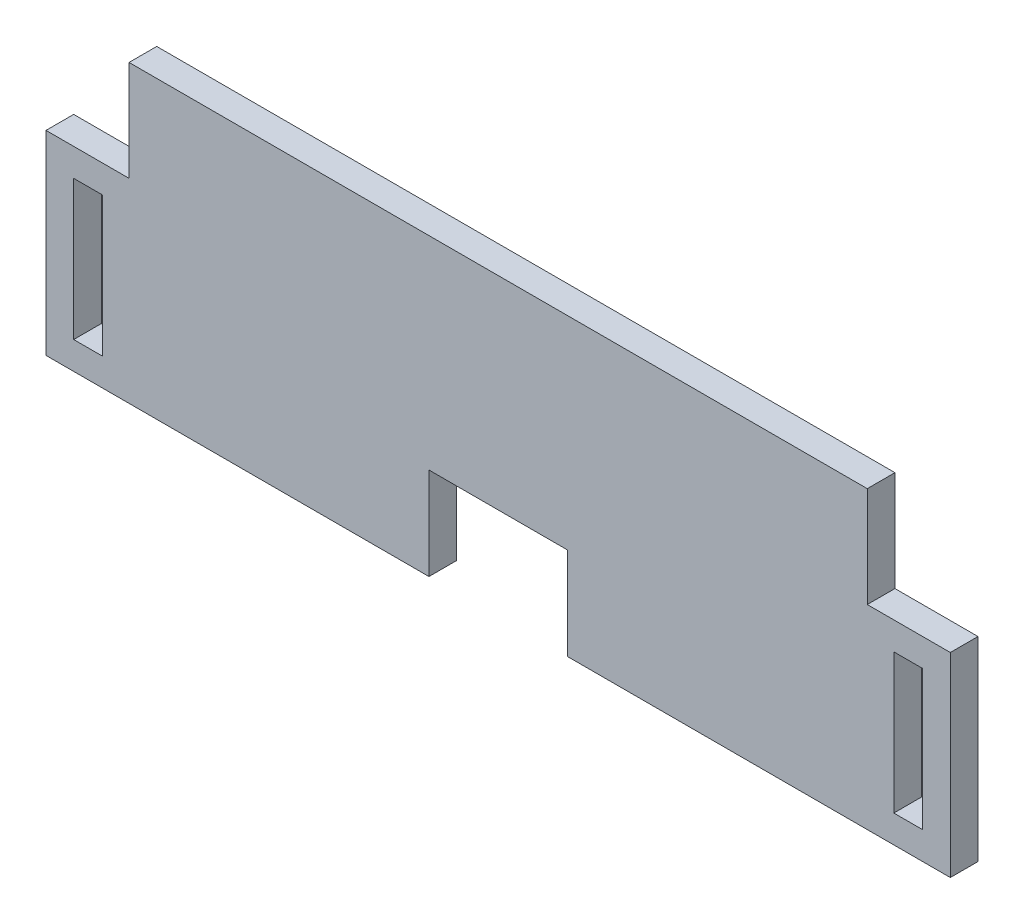
ISO-10303-21;
HEADER;
FILE_DESCRIPTION(('STEP AP214'),'2;1');
FILE_NAME('part.step','',(''),(''),'','','');
FILE_SCHEMA(('AUTOMOTIVE_DESIGN { 1 0 10303 214 1 1 1 1 }'));
ENDSEC;
DATA;
#1=APPLICATION_CONTEXT('core data for automotive mechanical design processes');
#2=APPLICATION_PROTOCOL_DEFINITION('international standard','automotive_design',2000,#1);
#3=PRODUCT_CONTEXT('',#1,'mechanical');
#4=PRODUCT('Part','Part','',(#3));
#5=PRODUCT_RELATED_PRODUCT_CATEGORY('part','',(#4));
#6=PRODUCT_DEFINITION_FORMATION('','',#4);
#7=PRODUCT_DEFINITION_CONTEXT('part definition',#1,'design');
#8=PRODUCT_DEFINITION('design','',#6,#7);
#9=PRODUCT_DEFINITION_SHAPE('','',#8);
#10=(LENGTH_UNIT() NAMED_UNIT(*) SI_UNIT(.MILLI.,.METRE.));
#11=(NAMED_UNIT(*) PLANE_ANGLE_UNIT() SI_UNIT($,.RADIAN.));
#12=(NAMED_UNIT(*) SI_UNIT($,.STERADIAN.) SOLID_ANGLE_UNIT());
#13=UNCERTAINTY_MEASURE_WITH_UNIT(LENGTH_MEASURE(1.E-05),#10,'distance_accuracy_value','');
#14=(GEOMETRIC_REPRESENTATION_CONTEXT(3) GLOBAL_UNCERTAINTY_ASSIGNED_CONTEXT((#13)) GLOBAL_UNIT_ASSIGNED_CONTEXT((#10,
#11,#12)) REPRESENTATION_CONTEXT('',''));
#15=CARTESIAN_POINT('',(0.,0.,0.));
#16=DIRECTION('',(0.,0.,1.));
#17=DIRECTION('',(1.,0.,0.));
#18=AXIS2_PLACEMENT_3D('',#15,#16,#17);
#19=CARTESIAN_POINT('',(0.,0.,3.));
#20=DIRECTION('',(0.,1.,0.));
#21=DIRECTION('',(0.,0.,1.));
#22=AXIS2_PLACEMENT_3D('',#19,#20,#21);
#23=PLANE('',#22);
#24=DIRECTION('',(0.,0.,1.));
#25=VECTOR('',#24,1.);
#26=CARTESIAN_POINT('',(7.5,0.,0.));
#27=LINE('',#26,#25);
#28=CARTESIAN_POINT('',(7.5,0.,0.));
#29=VERTEX_POINT('',#28);
#30=CARTESIAN_POINT('',(7.5,0.,3.));
#31=VERTEX_POINT('',#30);
#32=EDGE_CURVE('E243',#29,#31,#27,.T.);
#33=ORIENTED_EDGE('',*,*,#32,.F.);
#34=DIRECTION('',(1.,0.,0.));
#35=VECTOR('',#34,1.);
#36=CARTESIAN_POINT('',(0.,0.,0.));
#37=LINE('',#36,#35);
#38=CARTESIAN_POINT('',(49.,0.,0.));
#39=VERTEX_POINT('',#38);
#40=EDGE_CURVE('E238',#29,#39,#37,.T.);
#41=ORIENTED_EDGE('',*,*,#40,.T.);
#42=DIRECTION('',(0.,0.,-1.));
#43=VECTOR('',#42,1.);
#44=CARTESIAN_POINT('',(49.,0.,3.));
#45=LINE('',#44,#43);
#46=CARTESIAN_POINT('',(49.,0.,3.));
#47=VERTEX_POINT('',#46);
#48=EDGE_CURVE('E219',#47,#39,#45,.T.);
#49=ORIENTED_EDGE('',*,*,#48,.F.);
#50=DIRECTION('',(1.,0.,0.));
#51=VECTOR('',#50,1.);
#52=CARTESIAN_POINT('',(0.,0.,3.));
#53=LINE('',#52,#51);
#54=EDGE_CURVE('E283',#31,#47,#53,.T.);
#55=ORIENTED_EDGE('',*,*,#54,.F.);
#56=EDGE_LOOP('',(#33,#41,#49,#55));
#57=FACE_BOUND('',#56,.T.);
#58=ADVANCED_FACE('F39',(#57),#23,.F.);
#59=DIRECTION('',(0.,0.,1.));
#60=VECTOR('',#59,1.);
#61=CARTESIAN_POINT('',(-7.5,0.,0.));
#62=LINE('',#61,#60);
#63=CARTESIAN_POINT('',(-7.5,0.,0.));
#64=VERTEX_POINT('',#63);
#65=CARTESIAN_POINT('',(-7.5,0.,3.));
#66=VERTEX_POINT('',#65);
#67=EDGE_CURVE('E56',#64,#66,#62,.T.);
#68=ORIENTED_EDGE('',*,*,#67,.T.);
#69=CARTESIAN_POINT('',(-49.,0.,3.));
#70=VERTEX_POINT('',#69);
#71=EDGE_CURVE('E127',#70,#66,#53,.T.);
#72=ORIENTED_EDGE('',*,*,#71,.F.);
#73=DIRECTION('',(0.,0.,-1.));
#74=VECTOR('',#73,1.);
#75=CARTESIAN_POINT('',(-49.,0.,3.));
#76=LINE('',#75,#74);
#77=CARTESIAN_POINT('',(-49.,0.,0.));
#78=VERTEX_POINT('',#77);
#79=EDGE_CURVE('E43',#70,#78,#76,.T.);
#80=ORIENTED_EDGE('',*,*,#79,.T.);
#81=EDGE_CURVE('E230',#78,#64,#37,.T.);
#82=ORIENTED_EDGE('',*,*,#81,.T.);
#83=EDGE_LOOP('',(#68,#72,#80,#82));
#84=FACE_BOUND('',#83,.T.);
#85=ADVANCED_FACE('F229',(#84),#23,.F.);
#86=CARTESIAN_POINT('',(0.,0.,3.));
#87=DIRECTION('',(0.,0.,1.));
#88=DIRECTION('',(1.,0.,0.));
#89=AXIS2_PLACEMENT_3D('',#86,#87,#88);
#90=PLANE('',#89);
#91=DIRECTION('',(1.,0.,0.));
#92=VECTOR('',#91,1.);
#93=CARTESIAN_POINT('',(0.,18.123,3.));
#94=LINE('',#93,#92);
#95=CARTESIAN_POINT('',(-46.,18.123,3.));
#96=VERTEX_POINT('',#95);
#97=CARTESIAN_POINT('',(-42.877,18.123,3.));
#98=VERTEX_POINT('',#97);
#99=EDGE_CURVE('E302',#96,#98,#94,.T.);
#100=ORIENTED_EDGE('',*,*,#99,.T.);
#101=DIRECTION('',(0.,-1.,0.));
#102=VECTOR('',#101,1.);
#103=CARTESIAN_POINT('',(-42.877,0.,3.));
#104=LINE('',#103,#102);
#105=CARTESIAN_POINT('',(-42.877,2.99299999999999,3.));
#106=VERTEX_POINT('',#105);
#107=EDGE_CURVE('E305',#98,#106,#104,.T.);
#108=ORIENTED_EDGE('',*,*,#107,.T.);
#109=DIRECTION('',(1.,0.,0.));
#110=VECTOR('',#109,1.);
#111=CARTESIAN_POINT('',(0.,2.99299999999999,3.));
#112=LINE('',#111,#110);
#113=CARTESIAN_POINT('',(-46.,2.99299999999999,3.));
#114=VERTEX_POINT('',#113);
#115=EDGE_CURVE('E307',#114,#106,#112,.T.);
#116=ORIENTED_EDGE('',*,*,#115,.F.);
#117=DIRECTION('',(0.,-1.,0.));
#118=VECTOR('',#117,1.);
#119=CARTESIAN_POINT('',(-46.,0.,3.));
#120=LINE('',#119,#118);
#121=EDGE_CURVE('E310',#96,#114,#120,.T.);
#122=ORIENTED_EDGE('',*,*,#121,.F.);
#123=EDGE_LOOP('',(#100,#108,#116,#122));
#124=FACE_BOUND('',#123,.T.);
#125=DIRECTION('',(-1.,0.,0.));
#126=VECTOR('',#125,1.);
#127=CARTESIAN_POINT('',(0.,18.123,3.));
#128=LINE('',#127,#126);
#129=CARTESIAN_POINT('',(46.,18.123,3.));
#130=VERTEX_POINT('',#129);
#131=CARTESIAN_POINT('',(42.877,18.123,3.));
#132=VERTEX_POINT('',#131);
#133=EDGE_CURVE('E187',#130,#132,#128,.T.);
#134=ORIENTED_EDGE('',*,*,#133,.F.);
#135=DIRECTION('',(0.,-1.,0.));
#136=VECTOR('',#135,1.);
#137=CARTESIAN_POINT('',(46.,0.,3.));
#138=LINE('',#137,#136);
#139=CARTESIAN_POINT('',(46.,2.993,3.));
#140=VERTEX_POINT('',#139);
#141=EDGE_CURVE('E181',#130,#140,#138,.T.);
#142=ORIENTED_EDGE('',*,*,#141,.T.);
#143=DIRECTION('',(-1.,0.,0.));
#144=VECTOR('',#143,1.);
#145=CARTESIAN_POINT('',(0.,2.99299999999999,3.));
#146=LINE('',#145,#144);
#147=CARTESIAN_POINT('',(42.877,2.993,3.));
#148=VERTEX_POINT('',#147);
#149=EDGE_CURVE('E171',#140,#148,#146,.T.);
#150=ORIENTED_EDGE('',*,*,#149,.T.);
#151=DIRECTION('',(0.,-1.,0.));
#152=VECTOR('',#151,1.);
#153=CARTESIAN_POINT('',(42.877,0.,3.));
#154=LINE('',#153,#152);
#155=EDGE_CURVE('E180',#132,#148,#154,.T.);
#156=ORIENTED_EDGE('',*,*,#155,.F.);
#157=EDGE_LOOP('',(#134,#142,#150,#156));
#158=FACE_BOUND('',#157,.T.);
#159=DIRECTION('',(1.,0.,0.));
#160=VECTOR('',#159,1.);
#161=CARTESIAN_POINT('',(-7.5,10.,3.));
#162=LINE('',#161,#160);
#163=CARTESIAN_POINT('',(-7.5,10.,3.));
#164=VERTEX_POINT('',#163);
#165=CARTESIAN_POINT('',(7.5,10.,3.));
#166=VERTEX_POINT('',#165);
#167=EDGE_CURVE('E342',#164,#166,#162,.T.);
#168=ORIENTED_EDGE('',*,*,#167,.T.);
#169=DIRECTION('',(0.,-1.,0.));
#170=VECTOR('',#169,1.);
#171=CARTESIAN_POINT('',(7.5,10.,3.));
#172=LINE('',#171,#170);
#173=EDGE_CURVE('E345',#166,#31,#172,.T.);
#174=ORIENTED_EDGE('',*,*,#173,.T.);
#175=ORIENTED_EDGE('',*,*,#54,.T.);
#176=DIRECTION('',(0.,-1.,0.));
#177=VECTOR('',#176,1.);
#178=CARTESIAN_POINT('',(49.,0.,3.));
#179=LINE('',#178,#177);
#180=CARTESIAN_POINT('',(49.,21.123,3.));
#181=VERTEX_POINT('',#180);
#182=EDGE_CURVE('E288',#181,#47,#179,.T.);
#183=ORIENTED_EDGE('',*,*,#182,.F.);
#184=DIRECTION('',(1.,0.,0.));
#185=VECTOR('',#184,1.);
#186=CARTESIAN_POINT('',(0.,21.123,3.));
#187=LINE('',#186,#185);
#188=CARTESIAN_POINT('',(40.,21.123,3.));
#189=VERTEX_POINT('',#188);
#190=EDGE_CURVE('E290',#189,#181,#187,.T.);
#191=ORIENTED_EDGE('',*,*,#190,.F.);
#192=DIRECTION('',(0.,1.,0.));
#193=VECTOR('',#192,1.);
#194=CARTESIAN_POINT('',(40.,0.,3.));
#195=LINE('',#194,#193);
#196=CARTESIAN_POINT('',(40.,32.,3.));
#197=VERTEX_POINT('',#196);
#198=EDGE_CURVE('E293',#189,#197,#195,.T.);
#199=ORIENTED_EDGE('',*,*,#198,.T.);
#200=DIRECTION('',(-1.,0.,0.));
#201=VECTOR('',#200,1.);
#202=CARTESIAN_POINT('',(0.,32.,3.));
#203=LINE('',#202,#201);
#204=CARTESIAN_POINT('',(-40.,32.,3.));
#205=VERTEX_POINT('',#204);
#206=EDGE_CURVE('E295',#197,#205,#203,.T.);
#207=ORIENTED_EDGE('',*,*,#206,.T.);
#208=DIRECTION('',(0.,1.,0.));
#209=VECTOR('',#208,1.);
#210=CARTESIAN_POINT('',(-40.,0.,3.));
#211=LINE('',#210,#209);
#212=CARTESIAN_POINT('',(-40.,21.123,3.));
#213=VERTEX_POINT('',#212);
#214=EDGE_CURVE('E297',#213,#205,#211,.T.);
#215=ORIENTED_EDGE('',*,*,#214,.F.);
#216=DIRECTION('',(-1.,0.,0.));
#217=VECTOR('',#216,1.);
#218=CARTESIAN_POINT('',(0.,21.123,3.));
#219=LINE('',#218,#217);
#220=CARTESIAN_POINT('',(-49.,21.123,3.));
#221=VERTEX_POINT('',#220);
#222=EDGE_CURVE('E300',#213,#221,#219,.T.);
#223=ORIENTED_EDGE('',*,*,#222,.T.);
#224=DIRECTION('',(0.,-1.,0.));
#225=VECTOR('',#224,1.);
#226=CARTESIAN_POINT('',(-49.,0.,3.));
#227=LINE('',#226,#225);
#228=EDGE_CURVE('E281',#221,#70,#227,.T.);
#229=ORIENTED_EDGE('',*,*,#228,.T.);
#230=ORIENTED_EDGE('',*,*,#71,.T.);
#231=DIRECTION('',(0.,1.,0.));
#232=VECTOR('',#231,1.);
#233=CARTESIAN_POINT('',(-7.5,0.,3.));
#234=LINE('',#233,#232);
#235=EDGE_CURVE('E339',#66,#164,#234,.T.);
#236=ORIENTED_EDGE('',*,*,#235,.T.);
#237=EDGE_LOOP('',(#168,#174,#175,#183,#191,#199,#207,#215,#223,#229,#230,#236));
#238=FACE_BOUND('',#237,.T.);
#239=ADVANCED_FACE('F185',(#124,#158,#238),#90,.T.);
#240=CARTESIAN_POINT('',(0.,0.,0.));
#241=DIRECTION('',(0.,0.,1.));
#242=DIRECTION('',(1.,0.,0.));
#243=AXIS2_PLACEMENT_3D('',#240,#241,#242);
#244=PLANE('',#243);
#245=DIRECTION('',(-1.,0.,0.));
#246=VECTOR('',#245,1.);
#247=CARTESIAN_POINT('',(0.,18.123,0.));
#248=LINE('',#247,#246);
#249=CARTESIAN_POINT('',(46.,18.123,0.));
#250=VERTEX_POINT('',#249);
#251=CARTESIAN_POINT('',(42.877,18.123,0.));
#252=VERTEX_POINT('',#251);
#253=EDGE_CURVE('E274',#250,#252,#248,.T.);
#254=ORIENTED_EDGE('',*,*,#253,.T.);
#255=DIRECTION('',(0.,-1.,0.));
#256=VECTOR('',#255,1.);
#257=CARTESIAN_POINT('',(42.877,0.,0.));
#258=LINE('',#257,#256);
#259=CARTESIAN_POINT('',(42.877,2.993,0.));
#260=VERTEX_POINT('',#259);
#261=EDGE_CURVE('E279',#252,#260,#258,.T.);
#262=ORIENTED_EDGE('',*,*,#261,.T.);
#263=DIRECTION('',(-1.,0.,0.));
#264=VECTOR('',#263,1.);
#265=CARTESIAN_POINT('',(0.,2.99299999999999,0.));
#266=LINE('',#265,#264);
#267=CARTESIAN_POINT('',(46.,2.993,0.));
#268=VERTEX_POINT('',#267);
#269=EDGE_CURVE('E277',#268,#260,#266,.T.);
#270=ORIENTED_EDGE('',*,*,#269,.F.);
#271=DIRECTION('',(0.,-1.,0.));
#272=VECTOR('',#271,1.);
#273=CARTESIAN_POINT('',(46.,0.,0.));
#274=LINE('',#273,#272);
#275=EDGE_CURVE('E192',#250,#268,#274,.T.);
#276=ORIENTED_EDGE('',*,*,#275,.F.);
#277=EDGE_LOOP('',(#254,#262,#270,#276));
#278=FACE_BOUND('',#277,.T.);
#279=DIRECTION('',(1.,0.,0.));
#280=VECTOR('',#279,1.);
#281=CARTESIAN_POINT('',(0.,18.123,0.));
#282=LINE('',#281,#280);
#283=CARTESIAN_POINT('',(-46.,18.123,0.));
#284=VERTEX_POINT('',#283);
#285=CARTESIAN_POINT('',(-42.877,18.123,0.));
#286=VERTEX_POINT('',#285);
#287=EDGE_CURVE('E262',#284,#286,#282,.T.);
#288=ORIENTED_EDGE('',*,*,#287,.F.);
#289=DIRECTION('',(0.,-1.,0.));
#290=VECTOR('',#289,1.);
#291=CARTESIAN_POINT('',(-46.,0.,0.));
#292=LINE('',#291,#290);
#293=CARTESIAN_POINT('',(-46.,2.99299999999999,0.));
#294=VERTEX_POINT('',#293);
#295=EDGE_CURVE('E271',#284,#294,#292,.T.);
#296=ORIENTED_EDGE('',*,*,#295,.T.);
#297=DIRECTION('',(1.,0.,0.));
#298=VECTOR('',#297,1.);
#299=CARTESIAN_POINT('',(0.,2.99299999999999,0.));
#300=LINE('',#299,#298);
#301=CARTESIAN_POINT('',(-42.877,2.99299999999999,0.));
#302=VERTEX_POINT('',#301);
#303=EDGE_CURVE('E268',#294,#302,#300,.T.);
#304=ORIENTED_EDGE('',*,*,#303,.T.);
#305=DIRECTION('',(0.,-1.,0.));
#306=VECTOR('',#305,1.);
#307=CARTESIAN_POINT('',(-42.877,0.,0.));
#308=LINE('',#307,#306);
#309=EDGE_CURVE('E265',#286,#302,#308,.T.);
#310=ORIENTED_EDGE('',*,*,#309,.F.);
#311=EDGE_LOOP('',(#288,#296,#304,#310));
#312=FACE_BOUND('',#311,.T.);
#313=DIRECTION('',(0.,-1.,0.));
#314=VECTOR('',#313,1.);
#315=CARTESIAN_POINT('',(7.5,10.,0.));
#316=LINE('',#315,#314);
#317=CARTESIAN_POINT('',(7.5,10.,0.));
#318=VERTEX_POINT('',#317);
#319=EDGE_CURVE('E326',#318,#29,#316,.T.);
#320=ORIENTED_EDGE('',*,*,#319,.F.);
#321=DIRECTION('',(1.,0.,0.));
#322=VECTOR('',#321,1.);
#323=CARTESIAN_POINT('',(-7.5,10.,0.));
#324=LINE('',#323,#322);
#325=CARTESIAN_POINT('',(-7.5,10.,0.));
#326=VERTEX_POINT('',#325);
#327=EDGE_CURVE('E328',#326,#318,#324,.T.);
#328=ORIENTED_EDGE('',*,*,#327,.F.);
#329=DIRECTION('',(0.,1.,0.));
#330=VECTOR('',#329,1.);
#331=CARTESIAN_POINT('',(-7.5,0.,0.));
#332=LINE('',#331,#330);
#333=EDGE_CURVE('E335',#64,#326,#332,.T.);
#334=ORIENTED_EDGE('',*,*,#333,.F.);
#335=ORIENTED_EDGE('',*,*,#81,.F.);
#336=DIRECTION('',(0.,-1.,0.));
#337=VECTOR('',#336,1.);
#338=CARTESIAN_POINT('',(-49.,0.,0.));
#339=LINE('',#338,#337);
#340=CARTESIAN_POINT('',(-49.,21.123,0.));
#341=VERTEX_POINT('',#340);
#342=EDGE_CURVE('E234',#341,#78,#339,.T.);
#343=ORIENTED_EDGE('',*,*,#342,.F.);
#344=DIRECTION('',(-1.,0.,0.));
#345=VECTOR('',#344,1.);
#346=CARTESIAN_POINT('',(0.,21.123,0.));
#347=LINE('',#346,#345);
#348=CARTESIAN_POINT('',(-40.,21.123,0.));
#349=VERTEX_POINT('',#348);
#350=EDGE_CURVE('E260',#349,#341,#347,.T.);
#351=ORIENTED_EDGE('',*,*,#350,.F.);
#352=DIRECTION('',(0.,1.,0.));
#353=VECTOR('',#352,1.);
#354=CARTESIAN_POINT('',(-40.,0.,0.));
#355=LINE('',#354,#353);
#356=CARTESIAN_POINT('',(-40.,32.,0.));
#357=VERTEX_POINT('',#356);
#358=EDGE_CURVE('E257',#349,#357,#355,.T.);
#359=ORIENTED_EDGE('',*,*,#358,.T.);
#360=DIRECTION('',(-1.,0.,0.));
#361=VECTOR('',#360,1.);
#362=CARTESIAN_POINT('',(0.,32.,0.));
#363=LINE('',#362,#361);
#364=CARTESIAN_POINT('',(40.,32.,0.));
#365=VERTEX_POINT('',#364);
#366=EDGE_CURVE('E254',#365,#357,#363,.T.);
#367=ORIENTED_EDGE('',*,*,#366,.F.);
#368=DIRECTION('',(0.,1.,0.));
#369=VECTOR('',#368,1.);
#370=CARTESIAN_POINT('',(40.,0.,0.));
#371=LINE('',#370,#369);
#372=CARTESIAN_POINT('',(40.,21.123,0.));
#373=VERTEX_POINT('',#372);
#374=EDGE_CURVE('E252',#373,#365,#371,.T.);
#375=ORIENTED_EDGE('',*,*,#374,.F.);
#376=DIRECTION('',(1.,0.,0.));
#377=VECTOR('',#376,1.);
#378=CARTESIAN_POINT('',(0.,21.123,0.));
#379=LINE('',#378,#377);
#380=CARTESIAN_POINT('',(49.,21.123,0.));
#381=VERTEX_POINT('',#380);
#382=EDGE_CURVE('E249',#373,#381,#379,.T.);
#383=ORIENTED_EDGE('',*,*,#382,.T.);
#384=DIRECTION('',(0.,-1.,0.));
#385=VECTOR('',#384,1.);
#386=CARTESIAN_POINT('',(49.,0.,0.));
#387=LINE('',#386,#385);
#388=EDGE_CURVE('E247',#381,#39,#387,.T.);
#389=ORIENTED_EDGE('',*,*,#388,.T.);
#390=ORIENTED_EDGE('',*,*,#40,.F.);
#391=EDGE_LOOP('',(#320,#328,#334,#335,#343,#351,#359,#367,#375,#383,#389,#390));
#392=FACE_BOUND('',#391,.T.);
#393=ADVANCED_FACE('F315',(#278,#312,#392),#244,.F.);
#394=CARTESIAN_POINT('',(0.,18.123,3.));
#395=DIRECTION('',(0.,-1.,0.));
#396=DIRECTION('',(0.,0.,-1.));
#397=AXIS2_PLACEMENT_3D('',#394,#395,#396);
#398=PLANE('',#397);
#399=ORIENTED_EDGE('',*,*,#253,.F.);
#400=DIRECTION('',(0.,0.,-1.));
#401=VECTOR('',#400,1.);
#402=CARTESIAN_POINT('',(46.,18.123,3.));
#403=LINE('',#402,#401);
#404=EDGE_CURVE('E11',#130,#250,#403,.T.);
#405=ORIENTED_EDGE('',*,*,#404,.F.);
#406=ORIENTED_EDGE('',*,*,#133,.T.);
#407=DIRECTION('',(0.,0.,-1.));
#408=VECTOR('',#407,1.);
#409=CARTESIAN_POINT('',(42.877,18.123,3.));
#410=LINE('',#409,#408);
#411=EDGE_CURVE('E65',#132,#252,#410,.T.);
#412=ORIENTED_EDGE('',*,*,#411,.T.);
#413=EDGE_LOOP('',(#399,#405,#406,#412));
#414=FACE_BOUND('',#413,.T.);
#415=ADVANCED_FACE('F313',(#414),#398,.T.);
#416=CARTESIAN_POINT('',(46.,0.,3.));
#417=DIRECTION('',(1.,0.,0.));
#418=DIRECTION('',(0.,1.,0.));
#419=AXIS2_PLACEMENT_3D('',#416,#417,#418);
#420=PLANE('',#419);
#421=ORIENTED_EDGE('',*,*,#275,.T.);
#422=DIRECTION('',(0.,0.,-1.));
#423=VECTOR('',#422,1.);
#424=CARTESIAN_POINT('',(46.,2.993,3.));
#425=LINE('',#424,#423);
#426=EDGE_CURVE('E48',#140,#268,#425,.T.);
#427=ORIENTED_EDGE('',*,*,#426,.F.);
#428=ORIENTED_EDGE('',*,*,#141,.F.);
#429=ORIENTED_EDGE('',*,*,#404,.T.);
#430=EDGE_LOOP('',(#421,#427,#428,#429));
#431=FACE_BOUND('',#430,.T.);
#432=ADVANCED_FACE('F190',(#431),#420,.F.);
#433=CARTESIAN_POINT('',(0.,2.99299999999999,3.));
#434=DIRECTION('',(0.,-1.,0.));
#435=DIRECTION('',(1.,0.,0.));
#436=AXIS2_PLACEMENT_3D('',#433,#434,#435);
#437=PLANE('',#436);
#438=ORIENTED_EDGE('',*,*,#269,.T.);
#439=DIRECTION('',(0.,0.,-1.));
#440=VECTOR('',#439,1.);
#441=CARTESIAN_POINT('',(42.877,2.993,3.));
#442=LINE('',#441,#440);
#443=EDGE_CURVE('E177',#148,#260,#442,.T.);
#444=ORIENTED_EDGE('',*,*,#443,.F.);
#445=ORIENTED_EDGE('',*,*,#149,.F.);
#446=ORIENTED_EDGE('',*,*,#426,.T.);
#447=EDGE_LOOP('',(#438,#444,#445,#446));
#448=FACE_BOUND('',#447,.T.);
#449=ADVANCED_FACE('F174',(#448),#437,.F.);
#450=CARTESIAN_POINT('',(0.,18.123,3.));
#451=DIRECTION('',(0.,1.,0.));
#452=DIRECTION('',(0.,0.,1.));
#453=AXIS2_PLACEMENT_3D('',#450,#451,#452);
#454=PLANE('',#453);
#455=ORIENTED_EDGE('',*,*,#287,.T.);
#456=DIRECTION('',(0.,0.,-1.));
#457=VECTOR('',#456,1.);
#458=CARTESIAN_POINT('',(-42.877,18.123,3.));
#459=LINE('',#458,#457);
#460=EDGE_CURVE('E203',#98,#286,#459,.T.);
#461=ORIENTED_EDGE('',*,*,#460,.F.);
#462=ORIENTED_EDGE('',*,*,#99,.F.);
#463=DIRECTION('',(0.,0.,-1.));
#464=VECTOR('',#463,1.);
#465=CARTESIAN_POINT('',(-46.,18.123,3.));
#466=LINE('',#465,#464);
#467=EDGE_CURVE('E197',#96,#284,#466,.T.);
#468=ORIENTED_EDGE('',*,*,#467,.T.);
#469=EDGE_LOOP('',(#455,#461,#462,#468));
#470=FACE_BOUND('',#469,.T.);
#471=ADVANCED_FACE('F573',(#470),#454,.F.);
#472=CARTESIAN_POINT('',(-42.877,0.,3.));
#473=DIRECTION('',(1.,0.,0.));
#474=DIRECTION('',(0.,0.,-1.));
#475=AXIS2_PLACEMENT_3D('',#472,#473,#474);
#476=PLANE('',#475);
#477=ORIENTED_EDGE('',*,*,#309,.T.);
#478=DIRECTION('',(0.,0.,-1.));
#479=VECTOR('',#478,1.);
#480=CARTESIAN_POINT('',(-42.877,2.99299999999999,3.));
#481=LINE('',#480,#479);
#482=EDGE_CURVE('E201',#106,#302,#481,.T.);
#483=ORIENTED_EDGE('',*,*,#482,.F.);
#484=ORIENTED_EDGE('',*,*,#107,.F.);
#485=ORIENTED_EDGE('',*,*,#460,.T.);
#486=EDGE_LOOP('',(#477,#483,#484,#485));
#487=FACE_BOUND('',#486,.T.);
#488=ADVANCED_FACE('F563',(#487),#476,.F.);
#489=CARTESIAN_POINT('',(0.,2.99299999999999,3.));
#490=DIRECTION('',(0.,1.,0.));
#491=DIRECTION('',(0.,0.,1.));
#492=AXIS2_PLACEMENT_3D('',#489,#490,#491);
#493=PLANE('',#492);
#494=ORIENTED_EDGE('',*,*,#303,.F.);
#495=DIRECTION('',(0.,0.,-1.));
#496=VECTOR('',#495,1.);
#497=CARTESIAN_POINT('',(-46.,2.99299999999999,3.));
#498=LINE('',#497,#496);
#499=EDGE_CURVE('E199',#114,#294,#498,.T.);
#500=ORIENTED_EDGE('',*,*,#499,.F.);
#501=ORIENTED_EDGE('',*,*,#115,.T.);
#502=ORIENTED_EDGE('',*,*,#482,.T.);
#503=EDGE_LOOP('',(#494,#500,#501,#502));
#504=FACE_BOUND('',#503,.T.);
#505=ADVANCED_FACE('F555',(#504),#493,.T.);
#506=CARTESIAN_POINT('',(-49.,0.,3.));
#507=DIRECTION('',(1.,0.,0.));
#508=DIRECTION('',(0.,1.,0.));
#509=AXIS2_PLACEMENT_3D('',#506,#507,#508);
#510=PLANE('',#509);
#511=ORIENTED_EDGE('',*,*,#342,.T.);
#512=ORIENTED_EDGE('',*,*,#79,.F.);
#513=ORIENTED_EDGE('',*,*,#228,.F.);
#514=DIRECTION('',(0.,0.,-1.));
#515=VECTOR('',#514,1.);
#516=CARTESIAN_POINT('',(-49.,21.123,3.));
#517=LINE('',#516,#515);
#518=EDGE_CURVE('E206',#221,#341,#517,.T.);
#519=ORIENTED_EDGE('',*,*,#518,.T.);
#520=EDGE_LOOP('',(#511,#512,#513,#519));
#521=FACE_BOUND('',#520,.T.);
#522=ADVANCED_FACE('F41',(#521),#510,.F.);
#523=CARTESIAN_POINT('',(49.,0.,3.));
#524=DIRECTION('',(1.,0.,0.));
#525=DIRECTION('',(0.,1.,0.));
#526=AXIS2_PLACEMENT_3D('',#523,#524,#525);
#527=PLANE('',#526);
#528=ORIENTED_EDGE('',*,*,#388,.F.);
#529=DIRECTION('',(0.,0.,-1.));
#530=VECTOR('',#529,1.);
#531=CARTESIAN_POINT('',(49.,21.123,3.));
#532=LINE('',#531,#530);
#533=EDGE_CURVE('E218',#181,#381,#532,.T.);
#534=ORIENTED_EDGE('',*,*,#533,.F.);
#535=ORIENTED_EDGE('',*,*,#182,.T.);
#536=ORIENTED_EDGE('',*,*,#48,.T.);
#537=EDGE_LOOP('',(#528,#534,#535,#536));
#538=FACE_BOUND('',#537,.T.);
#539=ADVANCED_FACE('F362',(#538),#527,.T.);
#540=CARTESIAN_POINT('',(0.,21.123,3.));
#541=DIRECTION('',(0.,1.,0.));
#542=DIRECTION('',(-1.,0.,0.));
#543=AXIS2_PLACEMENT_3D('',#540,#541,#542);
#544=PLANE('',#543);
#545=ORIENTED_EDGE('',*,*,#382,.F.);
#546=DIRECTION('',(0.,0.,-1.));
#547=VECTOR('',#546,1.);
#548=CARTESIAN_POINT('',(40.,21.123,3.));
#549=LINE('',#548,#547);
#550=EDGE_CURVE('E216',#189,#373,#549,.T.);
#551=ORIENTED_EDGE('',*,*,#550,.F.);
#552=ORIENTED_EDGE('',*,*,#190,.T.);
#553=ORIENTED_EDGE('',*,*,#533,.T.);
#554=EDGE_LOOP('',(#545,#551,#552,#553));
#555=FACE_BOUND('',#554,.T.);
#556=ADVANCED_FACE('F366',(#555),#544,.T.);
#557=CARTESIAN_POINT('',(40.,0.,3.));
#558=DIRECTION('',(-1.,0.,0.));
#559=DIRECTION('',(0.,-1.,0.));
#560=AXIS2_PLACEMENT_3D('',#557,#558,#559);
#561=PLANE('',#560);
#562=ORIENTED_EDGE('',*,*,#374,.T.);
#563=DIRECTION('',(0.,0.,-1.));
#564=VECTOR('',#563,1.);
#565=CARTESIAN_POINT('',(40.,32.,3.));
#566=LINE('',#565,#564);
#567=EDGE_CURVE('E213',#197,#365,#566,.T.);
#568=ORIENTED_EDGE('',*,*,#567,.F.);
#569=ORIENTED_EDGE('',*,*,#198,.F.);
#570=ORIENTED_EDGE('',*,*,#550,.T.);
#571=EDGE_LOOP('',(#562,#568,#569,#570));
#572=FACE_BOUND('',#571,.T.);
#573=ADVANCED_FACE('F371',(#572),#561,.F.);
#574=CARTESIAN_POINT('',(0.,32.,3.));
#575=DIRECTION('',(0.,-1.,0.));
#576=DIRECTION('',(0.,0.,-1.));
#577=AXIS2_PLACEMENT_3D('',#574,#575,#576);
#578=PLANE('',#577);
#579=ORIENTED_EDGE('',*,*,#366,.T.);
#580=DIRECTION('',(0.,0.,-1.));
#581=VECTOR('',#580,1.);
#582=CARTESIAN_POINT('',(-40.,32.,3.));
#583=LINE('',#582,#581);
#584=EDGE_CURVE('E211',#205,#357,#583,.T.);
#585=ORIENTED_EDGE('',*,*,#584,.F.);
#586=ORIENTED_EDGE('',*,*,#206,.F.);
#587=ORIENTED_EDGE('',*,*,#567,.T.);
#588=EDGE_LOOP('',(#579,#585,#586,#587));
#589=FACE_BOUND('',#588,.T.);
#590=ADVANCED_FACE('F376',(#589),#578,.F.);
#591=CARTESIAN_POINT('',(-40.,0.,3.));
#592=DIRECTION('',(-1.,0.,0.));
#593=DIRECTION('',(0.,-1.,0.));
#594=AXIS2_PLACEMENT_3D('',#591,#592,#593);
#595=PLANE('',#594);
#596=ORIENTED_EDGE('',*,*,#358,.F.);
#597=DIRECTION('',(0.,0.,-1.));
#598=VECTOR('',#597,1.);
#599=CARTESIAN_POINT('',(-40.,21.123,3.));
#600=LINE('',#599,#598);
#601=EDGE_CURVE('E209',#213,#349,#600,.T.);
#602=ORIENTED_EDGE('',*,*,#601,.F.);
#603=ORIENTED_EDGE('',*,*,#214,.T.);
#604=ORIENTED_EDGE('',*,*,#584,.T.);
#605=EDGE_LOOP('',(#596,#602,#603,#604));
#606=FACE_BOUND('',#605,.T.);
#607=ADVANCED_FACE('F380',(#606),#595,.T.);
#608=CARTESIAN_POINT('',(-46.,0.,3.));
#609=DIRECTION('',(1.,0.,0.));
#610=DIRECTION('',(0.,1.,0.));
#611=AXIS2_PLACEMENT_3D('',#608,#609,#610);
#612=PLANE('',#611);
#613=ORIENTED_EDGE('',*,*,#295,.F.);
#614=ORIENTED_EDGE('',*,*,#467,.F.);
#615=ORIENTED_EDGE('',*,*,#121,.T.);
#616=ORIENTED_EDGE('',*,*,#499,.T.);
#617=EDGE_LOOP('',(#613,#614,#615,#616));
#618=FACE_BOUND('',#617,.T.);
#619=ADVANCED_FACE('F385',(#618),#612,.T.);
#620=CARTESIAN_POINT('',(0.,21.123,3.));
#621=DIRECTION('',(0.,-1.,0.));
#622=DIRECTION('',(1.,0.,0.));
#623=AXIS2_PLACEMENT_3D('',#620,#621,#622);
#624=PLANE('',#623);
#625=ORIENTED_EDGE('',*,*,#350,.T.);
#626=ORIENTED_EDGE('',*,*,#518,.F.);
#627=ORIENTED_EDGE('',*,*,#222,.F.);
#628=ORIENTED_EDGE('',*,*,#601,.T.);
#629=EDGE_LOOP('',(#625,#626,#627,#628));
#630=FACE_BOUND('',#629,.T.);
#631=ADVANCED_FACE('F383',(#630),#624,.F.);
#632=CARTESIAN_POINT('',(42.877,0.,3.));
#633=DIRECTION('',(1.,0.,0.));
#634=DIRECTION('',(0.,1.,0.));
#635=AXIS2_PLACEMENT_3D('',#632,#633,#634);
#636=PLANE('',#635);
#637=ORIENTED_EDGE('',*,*,#261,.F.);
#638=ORIENTED_EDGE('',*,*,#411,.F.);
#639=ORIENTED_EDGE('',*,*,#155,.T.);
#640=ORIENTED_EDGE('',*,*,#443,.T.);
#641=EDGE_LOOP('',(#637,#638,#639,#640));
#642=FACE_BOUND('',#641,.T.);
#643=ADVANCED_FACE('F314',(#642),#636,.T.);
#644=CARTESIAN_POINT('',(-7.5,10.,0.));
#645=DIRECTION('',(0.,-1.,0.));
#646=DIRECTION('',(1.,0.,0.));
#647=AXIS2_PLACEMENT_3D('',#644,#645,#646);
#648=PLANE('',#647);
#649=ORIENTED_EDGE('',*,*,#167,.F.);
#650=DIRECTION('',(0.,0.,1.));
#651=VECTOR('',#650,1.);
#652=CARTESIAN_POINT('',(-7.5,10.,0.));
#653=LINE('',#652,#651);
#654=EDGE_CURVE('E337',#326,#164,#653,.T.);
#655=ORIENTED_EDGE('',*,*,#654,.F.);
#656=ORIENTED_EDGE('',*,*,#327,.T.);
#657=DIRECTION('',(0.,0.,1.));
#658=VECTOR('',#657,1.);
#659=CARTESIAN_POINT('',(7.5,10.,0.));
#660=LINE('',#659,#658);
#661=EDGE_CURVE('E239',#318,#166,#660,.T.);
#662=ORIENTED_EDGE('',*,*,#661,.T.);
#663=EDGE_LOOP('',(#649,#655,#656,#662));
#664=FACE_BOUND('',#663,.T.);
#665=ADVANCED_FACE('F391',(#664),#648,.T.);
#666=CARTESIAN_POINT('',(7.5,10.,0.));
#667=DIRECTION('',(-1.,0.,0.));
#668=DIRECTION('',(0.,-1.,0.));
#669=AXIS2_PLACEMENT_3D('',#666,#667,#668);
#670=PLANE('',#669);
#671=ORIENTED_EDGE('',*,*,#173,.F.);
#672=ORIENTED_EDGE('',*,*,#661,.F.);
#673=ORIENTED_EDGE('',*,*,#319,.T.);
#674=ORIENTED_EDGE('',*,*,#32,.T.);
#675=EDGE_LOOP('',(#671,#672,#673,#674));
#676=FACE_BOUND('',#675,.T.);
#677=ADVANCED_FACE('F354',(#676),#670,.T.);
#678=CARTESIAN_POINT('',(-7.5,0.,0.));
#679=DIRECTION('',(1.,0.,0.));
#680=DIRECTION('',(0.,0.,-1.));
#681=AXIS2_PLACEMENT_3D('',#678,#679,#680);
#682=PLANE('',#681);
#683=ORIENTED_EDGE('',*,*,#235,.F.);
#684=ORIENTED_EDGE('',*,*,#67,.F.);
#685=ORIENTED_EDGE('',*,*,#333,.T.);
#686=ORIENTED_EDGE('',*,*,#654,.T.);
#687=EDGE_LOOP('',(#683,#684,#685,#686));
#688=FACE_BOUND('',#687,.T.);
#689=ADVANCED_FACE('F476',(#688),#682,.T.);
#690=CLOSED_SHELL('',(#58,#85,#239,#393,#415,#432,#449,#471,#488,#505,#522,#539,#556,#573,#590,
#607,#619,#631,#643,#665,#677,#689));
#691=MANIFOLD_SOLID_BREP('B2',#690);
#692=ADVANCED_BREP_SHAPE_REPRESENTATION('',(#18,#691),#14);
#693=SHAPE_DEFINITION_REPRESENTATION(#9,#692);
ENDSEC;
END-ISO-10303-21;
